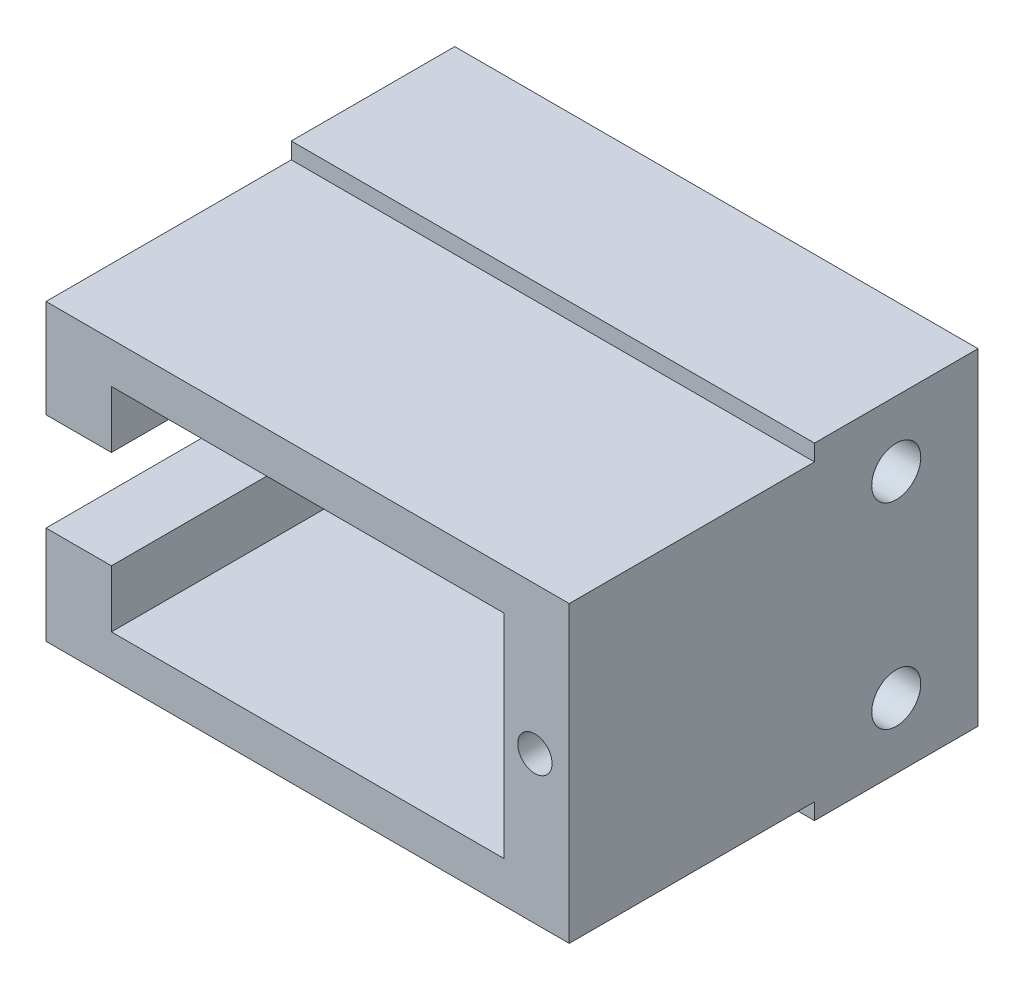
ISO-10303-21;
HEADER;
FILE_DESCRIPTION(('STEP AP214'),'2;1');
FILE_NAME('part.step','',(''),(''),'','','');
FILE_SCHEMA(('AUTOMOTIVE_DESIGN { 1 0 10303 214 1 1 1 1 }'));
ENDSEC;
DATA;
#1=APPLICATION_CONTEXT('core data for automotive mechanical design processes');
#2=APPLICATION_PROTOCOL_DEFINITION('international standard','automotive_design',2000,#1);
#3=PRODUCT_CONTEXT('',#1,'mechanical');
#4=PRODUCT('Part','Part','',(#3));
#5=PRODUCT_RELATED_PRODUCT_CATEGORY('part','',(#4));
#6=PRODUCT_DEFINITION_FORMATION('','',#4);
#7=PRODUCT_DEFINITION_CONTEXT('part definition',#1,'design');
#8=PRODUCT_DEFINITION('design','',#6,#7);
#9=PRODUCT_DEFINITION_SHAPE('','',#8);
#10=(LENGTH_UNIT() NAMED_UNIT(*) SI_UNIT(.MILLI.,.METRE.));
#11=(NAMED_UNIT(*) PLANE_ANGLE_UNIT() SI_UNIT($,.RADIAN.));
#12=(NAMED_UNIT(*) SI_UNIT($,.STERADIAN.) SOLID_ANGLE_UNIT());
#13=UNCERTAINTY_MEASURE_WITH_UNIT(LENGTH_MEASURE(1.E-05),#10,'distance_accuracy_value','');
#14=(GEOMETRIC_REPRESENTATION_CONTEXT(3) GLOBAL_UNCERTAINTY_ASSIGNED_CONTEXT((#13)) GLOBAL_UNIT_ASSIGNED_CONTEXT((#10,
#11,#12)) REPRESENTATION_CONTEXT('',''));
#15=CARTESIAN_POINT('',(0.,0.,0.));
#16=DIRECTION('',(0.,0.,1.));
#17=DIRECTION('',(1.,0.,0.));
#18=AXIS2_PLACEMENT_3D('',#15,#16,#17);
#19=CARTESIAN_POINT('',(-16.,10.,10.));
#20=DIRECTION('',(1.,0.,0.));
#21=DIRECTION('',(0.,0.,-1.));
#22=AXIS2_PLACEMENT_3D('',#19,#20,#21);
#23=PLANE('',#22);
#24=DIRECTION('',(0.,-1.,0.));
#25=VECTOR('',#24,1.);
#26=CARTESIAN_POINT('',(-16.,10.,0.));
#27=LINE('',#26,#25);
#28=CARTESIAN_POINT('',(-16.,10.,0.));
#29=VERTEX_POINT('',#28);
#30=CARTESIAN_POINT('',(-16.,3.,0.));
#31=VERTEX_POINT('',#30);
#32=EDGE_CURVE('E261',#29,#31,#27,.T.);
#33=ORIENTED_EDGE('',*,*,#32,.T.);
#34=DIRECTION('',(0.,0.,-1.));
#35=VECTOR('',#34,1.);
#36=CARTESIAN_POINT('',(-16.,3.,0.));
#37=LINE('',#36,#35);
#38=CARTESIAN_POINT('',(-16.,3.,25.));
#39=VERTEX_POINT('',#38);
#40=EDGE_CURVE('E167',#39,#31,#37,.T.);
#41=ORIENTED_EDGE('',*,*,#40,.F.);
#42=DIRECTION('',(0.,-1.,0.));
#43=VECTOR('',#42,1.);
#44=CARTESIAN_POINT('',(-16.,-9.00000000000001,25.));
#45=LINE('',#44,#43);
#46=CARTESIAN_POINT('',(-16.,9.,25.));
#47=VERTEX_POINT('',#46);
#48=EDGE_CURVE('E218',#47,#39,#45,.T.);
#49=ORIENTED_EDGE('',*,*,#48,.F.);
#50=DIRECTION('',(0.,0.,-1.));
#51=VECTOR('',#50,1.);
#52=CARTESIAN_POINT('',(-16.,9.,25.));
#53=LINE('',#52,#51);
#54=CARTESIAN_POINT('',(-16.,9.,10.));
#55=VERTEX_POINT('',#54);
#56=EDGE_CURVE('E228',#47,#55,#53,.T.);
#57=ORIENTED_EDGE('',*,*,#56,.T.);
#58=DIRECTION('',(0.,-1.,0.));
#59=VECTOR('',#58,1.);
#60=CARTESIAN_POINT('',(-16.,10.,10.));
#61=LINE('',#60,#59);
#62=CARTESIAN_POINT('',(-16.,10.,10.));
#63=VERTEX_POINT('',#62);
#64=EDGE_CURVE('E252',#63,#55,#61,.T.);
#65=ORIENTED_EDGE('',*,*,#64,.F.);
#66=DIRECTION('',(0.,0.,-1.));
#67=VECTOR('',#66,1.);
#68=CARTESIAN_POINT('',(-16.,10.,10.));
#69=LINE('',#68,#67);
#70=EDGE_CURVE('E41',#63,#29,#69,.T.);
#71=ORIENTED_EDGE('',*,*,#70,.T.);
#72=EDGE_LOOP('',(#33,#41,#49,#57,#65,#71));
#73=FACE_BOUND('',#72,.T.);
#74=ADVANCED_FACE('F33',(#73),#23,.F.);
#75=CARTESIAN_POINT('',(-12.,6.5,25.));
#76=DIRECTION('',(1.,0.,0.));
#77=DIRECTION('',(0.,0.,-1.));
#78=AXIS2_PLACEMENT_3D('',#75,#76,#77);
#79=PLANE('',#78);
#80=DIRECTION('',(0.,0.,-1.));
#81=VECTOR('',#80,1.);
#82=CARTESIAN_POINT('',(-12.,3.,0.));
#83=LINE('',#82,#81);
#84=CARTESIAN_POINT('',(-12.,3.,25.));
#85=VERTEX_POINT('',#84);
#86=CARTESIAN_POINT('',(-12.,3.,10.));
#87=VERTEX_POINT('',#86);
#88=EDGE_CURVE('E174',#85,#87,#83,.T.);
#89=ORIENTED_EDGE('',*,*,#88,.T.);
#90=DIRECTION('',(0.,-1.,0.));
#91=VECTOR('',#90,1.);
#92=CARTESIAN_POINT('',(-12.,6.5,10.));
#93=LINE('',#92,#91);
#94=CARTESIAN_POINT('',(-12.,6.5,10.));
#95=VERTEX_POINT('',#94);
#96=EDGE_CURVE('E202',#95,#87,#93,.T.);
#97=ORIENTED_EDGE('',*,*,#96,.F.);
#98=DIRECTION('',(0.,0.,-1.));
#99=VECTOR('',#98,1.);
#100=CARTESIAN_POINT('',(-12.,6.5,25.));
#101=LINE('',#100,#99);
#102=CARTESIAN_POINT('',(-12.,6.5,25.));
#103=VERTEX_POINT('',#102);
#104=EDGE_CURVE('E212',#103,#95,#101,.T.);
#105=ORIENTED_EDGE('',*,*,#104,.F.);
#106=DIRECTION('',(0.,-1.,0.));
#107=VECTOR('',#106,1.);
#108=CARTESIAN_POINT('',(-12.,6.5,25.));
#109=LINE('',#108,#107);
#110=EDGE_CURVE('E189',#103,#85,#109,.T.);
#111=ORIENTED_EDGE('',*,*,#110,.T.);
#112=EDGE_LOOP('',(#89,#97,#105,#111));
#113=FACE_BOUND('',#112,.T.);
#114=ADVANCED_FACE('F355',(#113),#79,.T.);
#115=CARTESIAN_POINT('',(0.,0.,10.));
#116=DIRECTION('',(0.,0.,1.));
#117=DIRECTION('',(1.,0.,0.));
#118=AXIS2_PLACEMENT_3D('',#115,#116,#117);
#119=PLANE('',#118);
#120=DIRECTION('',(-1.,0.,0.));
#121=VECTOR('',#120,1.);
#122=CARTESIAN_POINT('',(-16.,9.,10.));
#123=LINE('',#122,#121);
#124=CARTESIAN_POINT('',(16.,9.,10.));
#125=VERTEX_POINT('',#124);
#126=EDGE_CURVE('E231',#125,#55,#123,.T.);
#127=ORIENTED_EDGE('',*,*,#126,.F.);
#128=DIRECTION('',(0.,1.,0.));
#129=VECTOR('',#128,1.);
#130=CARTESIAN_POINT('',(16.,10.,10.));
#131=LINE('',#130,#129);
#132=CARTESIAN_POINT('',(16.,10.,10.));
#133=VERTEX_POINT('',#132);
#134=EDGE_CURVE('E249',#125,#133,#131,.T.);
#135=ORIENTED_EDGE('',*,*,#134,.T.);
#136=DIRECTION('',(-1.,0.,0.));
#137=VECTOR('',#136,1.);
#138=CARTESIAN_POINT('',(-16.,10.,10.));
#139=LINE('',#138,#137);
#140=EDGE_CURVE('E248',#133,#63,#139,.T.);
#141=ORIENTED_EDGE('',*,*,#140,.T.);
#142=ORIENTED_EDGE('',*,*,#64,.T.);
#143=EDGE_LOOP('',(#127,#135,#141,#142));
#144=FACE_BOUND('',#143,.T.);
#145=ADVANCED_FACE('F316',(#144),#119,.T.);
#146=CARTESIAN_POINT('',(16.,10.,10.));
#147=DIRECTION('',(-1.,0.,0.));
#148=DIRECTION('',(0.,-1.,0.));
#149=AXIS2_PLACEMENT_3D('',#146,#147,#148);
#150=PLANE('',#149);
#151=CARTESIAN_POINT('',(16.,6.,5.));
#152=DIRECTION('',(1.,0.,0.));
#153=DIRECTION('',(0.,1.,0.));
#154=AXIS2_PLACEMENT_3D('',#151,#152,#153);
#155=CIRCLE('',#154,1.5);
#156=CARTESIAN_POINT('',(16.,7.5,5.));
#157=VERTEX_POINT('',#156);
#158=EDGE_CURVE('E298',#157,#157,#155,.T.);
#159=ORIENTED_EDGE('',*,*,#158,.F.);
#160=EDGE_LOOP('',(#159));
#161=FACE_BOUND('',#160,.T.);
#162=CARTESIAN_POINT('',(16.,-6.,5.));
#163=DIRECTION('',(1.,0.,0.));
#164=DIRECTION('',(0.,1.,0.));
#165=AXIS2_PLACEMENT_3D('',#162,#163,#164);
#166=CIRCLE('',#165,1.5);
#167=CARTESIAN_POINT('',(16.,-4.5,5.));
#168=VERTEX_POINT('',#167);
#169=EDGE_CURVE('E292',#168,#168,#166,.T.);
#170=ORIENTED_EDGE('',*,*,#169,.F.);
#171=EDGE_LOOP('',(#170));
#172=FACE_BOUND('',#171,.T.);
#173=DIRECTION('',(0.,1.,0.));
#174=VECTOR('',#173,1.);
#175=CARTESIAN_POINT('',(16.,10.,0.));
#176=LINE('',#175,#174);
#177=CARTESIAN_POINT('',(16.,-10.,0.));
#178=VERTEX_POINT('',#177);
#179=CARTESIAN_POINT('',(16.,10.,0.));
#180=VERTEX_POINT('',#179);
#181=EDGE_CURVE('E245',#178,#180,#176,.T.);
#182=ORIENTED_EDGE('',*,*,#181,.T.);
#183=DIRECTION('',(0.,0.,-1.));
#184=VECTOR('',#183,1.);
#185=CARTESIAN_POINT('',(16.,10.,10.));
#186=LINE('',#185,#184);
#187=EDGE_CURVE('E11',#133,#180,#186,.T.);
#188=ORIENTED_EDGE('',*,*,#187,.F.);
#189=ORIENTED_EDGE('',*,*,#134,.F.);
#190=DIRECTION('',(0.,0.,-1.));
#191=VECTOR('',#190,1.);
#192=CARTESIAN_POINT('',(16.,9.,25.));
#193=LINE('',#192,#191);
#194=CARTESIAN_POINT('',(16.,9.,25.));
#195=VERTEX_POINT('',#194);
#196=EDGE_CURVE('E236',#195,#125,#193,.T.);
#197=ORIENTED_EDGE('',*,*,#196,.F.);
#198=DIRECTION('',(0.,1.,0.));
#199=VECTOR('',#198,1.);
#200=CARTESIAN_POINT('',(16.,9.,25.));
#201=LINE('',#200,#199);
#202=CARTESIAN_POINT('',(16.,-9.,25.));
#203=VERTEX_POINT('',#202);
#204=EDGE_CURVE('E224',#203,#195,#201,.T.);
#205=ORIENTED_EDGE('',*,*,#204,.F.);
#206=DIRECTION('',(0.,0.,-1.));
#207=VECTOR('',#206,1.);
#208=CARTESIAN_POINT('',(16.,-9.,25.));
#209=LINE('',#208,#207);
#210=CARTESIAN_POINT('',(16.,-9.,10.));
#211=VERTEX_POINT('',#210);
#212=EDGE_CURVE('E239',#203,#211,#209,.T.);
#213=ORIENTED_EDGE('',*,*,#212,.T.);
#214=CARTESIAN_POINT('',(16.,-10.,10.));
#215=VERTEX_POINT('',#214);
#216=EDGE_CURVE('E246',#215,#211,#131,.T.);
#217=ORIENTED_EDGE('',*,*,#216,.F.);
#218=DIRECTION('',(0.,0.,-1.));
#219=VECTOR('',#218,1.);
#220=CARTESIAN_POINT('',(16.,-10.,10.));
#221=LINE('',#220,#219);
#222=EDGE_CURVE('E256',#215,#178,#221,.T.);
#223=ORIENTED_EDGE('',*,*,#222,.T.);
#224=EDGE_LOOP('',(#182,#188,#189,#197,#205,#213,#217,#223));
#225=FACE_BOUND('',#224,.T.);
#226=ADVANCED_FACE('F35',(#161,#172,#225),#150,.F.);
#227=CARTESIAN_POINT('',(-16.,10.,10.));
#228=DIRECTION('',(0.,-1.,0.));
#229=DIRECTION('',(0.,0.,-1.));
#230=AXIS2_PLACEMENT_3D('',#227,#228,#229);
#231=PLANE('',#230);
#232=DIRECTION('',(-1.,0.,0.));
#233=VECTOR('',#232,1.);
#234=CARTESIAN_POINT('',(-16.,10.,0.));
#235=LINE('',#234,#233);
#236=EDGE_CURVE('E259',#180,#29,#235,.T.);
#237=ORIENTED_EDGE('',*,*,#236,.T.);
#238=ORIENTED_EDGE('',*,*,#70,.F.);
#239=ORIENTED_EDGE('',*,*,#140,.F.);
#240=ORIENTED_EDGE('',*,*,#187,.T.);
#241=EDGE_LOOP('',(#237,#238,#239,#240));
#242=FACE_BOUND('',#241,.T.);
#243=ADVANCED_FACE('F315',(#242),#231,.F.);
#244=CARTESIAN_POINT('',(-16.,-3.,25.));
#245=VERTEX_POINT('',#244);
#246=CARTESIAN_POINT('',(-16.,-9.00000000000001,25.));
#247=VERTEX_POINT('',#246);
#248=EDGE_CURVE('E222',#245,#247,#45,.T.);
#249=ORIENTED_EDGE('',*,*,#248,.F.);
#250=DIRECTION('',(0.,0.,1.));
#251=VECTOR('',#250,1.);
#252=CARTESIAN_POINT('',(-16.,-3.,25.));
#253=LINE('',#252,#251);
#254=CARTESIAN_POINT('',(-16.,-3.,0.));
#255=VERTEX_POINT('',#254);
#256=EDGE_CURVE('E283',#255,#245,#253,.T.);
#257=ORIENTED_EDGE('',*,*,#256,.F.);
#258=CARTESIAN_POINT('',(-16.,-10.,0.));
#259=VERTEX_POINT('',#258);
#260=EDGE_CURVE('E172',#255,#259,#27,.T.);
#261=ORIENTED_EDGE('',*,*,#260,.T.);
#262=DIRECTION('',(0.,0.,-1.));
#263=VECTOR('',#262,1.);
#264=CARTESIAN_POINT('',(-16.,-10.,10.));
#265=LINE('',#264,#263);
#266=CARTESIAN_POINT('',(-16.,-10.,10.));
#267=VERTEX_POINT('',#266);
#268=EDGE_CURVE('E268',#267,#259,#265,.T.);
#269=ORIENTED_EDGE('',*,*,#268,.F.);
#270=CARTESIAN_POINT('',(-16.,-9.,10.));
#271=VERTEX_POINT('',#270);
#272=EDGE_CURVE('E251',#271,#267,#61,.T.);
#273=ORIENTED_EDGE('',*,*,#272,.F.);
#274=DIRECTION('',(0.,0.,-1.));
#275=VECTOR('',#274,1.);
#276=CARTESIAN_POINT('',(-16.,-9.00000000000001,25.));
#277=LINE('',#276,#275);
#278=EDGE_CURVE('E242',#247,#271,#277,.T.);
#279=ORIENTED_EDGE('',*,*,#278,.F.);
#280=EDGE_LOOP('',(#249,#257,#261,#269,#273,#279));
#281=FACE_BOUND('',#280,.T.);
#282=ADVANCED_FACE('F330',(#281),#23,.F.);
#283=CARTESIAN_POINT('',(-16.,-10.,10.));
#284=DIRECTION('',(0.,1.,0.));
#285=DIRECTION('',(0.,0.,1.));
#286=AXIS2_PLACEMENT_3D('',#283,#284,#285);
#287=PLANE('',#286);
#288=DIRECTION('',(1.,0.,0.));
#289=VECTOR('',#288,1.);
#290=CARTESIAN_POINT('',(-16.,-10.,0.));
#291=LINE('',#290,#289);
#292=EDGE_CURVE('E264',#259,#178,#291,.T.);
#293=ORIENTED_EDGE('',*,*,#292,.T.);
#294=ORIENTED_EDGE('',*,*,#222,.F.);
#295=DIRECTION('',(1.,0.,0.));
#296=VECTOR('',#295,1.);
#297=CARTESIAN_POINT('',(-16.,-10.,10.));
#298=LINE('',#297,#296);
#299=EDGE_CURVE('E254',#267,#215,#298,.T.);
#300=ORIENTED_EDGE('',*,*,#299,.F.);
#301=ORIENTED_EDGE('',*,*,#268,.T.);
#302=EDGE_LOOP('',(#293,#294,#300,#301));
#303=FACE_BOUND('',#302,.T.);
#304=ADVANCED_FACE('F324',(#303),#287,.F.);
#305=DIRECTION('',(1.,0.,0.));
#306=VECTOR('',#305,1.);
#307=CARTESIAN_POINT('',(16.,-9.,10.));
#308=LINE('',#307,#306);
#309=EDGE_CURVE('E217',#271,#211,#308,.T.);
#310=ORIENTED_EDGE('',*,*,#309,.F.);
#311=ORIENTED_EDGE('',*,*,#272,.T.);
#312=ORIENTED_EDGE('',*,*,#299,.T.);
#313=ORIENTED_EDGE('',*,*,#216,.T.);
#314=EDGE_LOOP('',(#310,#311,#312,#313));
#315=FACE_BOUND('',#314,.T.);
#316=ADVANCED_FACE('F370',(#315),#119,.T.);
#317=CARTESIAN_POINT('',(0.,0.,0.));
#318=DIRECTION('',(0.,0.,1.));
#319=DIRECTION('',(1.,0.,0.));
#320=AXIS2_PLACEMENT_3D('',#317,#318,#319);
#321=PLANE('',#320);
#322=DIRECTION('',(0.,-1.,0.));
#323=VECTOR('',#322,1.);
#324=CARTESIAN_POINT('',(-12.,-3.,0.));
#325=LINE('',#324,#323);
#326=CARTESIAN_POINT('',(-12.,3.,0.));
#327=VERTEX_POINT('',#326);
#328=CARTESIAN_POINT('',(-12.,-3.,0.));
#329=VERTEX_POINT('',#328);
#330=EDGE_CURVE('E161',#327,#329,#325,.T.);
#331=ORIENTED_EDGE('',*,*,#330,.F.);
#332=DIRECTION('',(-1.,0.,0.));
#333=VECTOR('',#332,1.);
#334=CARTESIAN_POINT('',(-12.,3.,0.));
#335=LINE('',#334,#333);
#336=EDGE_CURVE('E199',#327,#31,#335,.T.);
#337=ORIENTED_EDGE('',*,*,#336,.T.);
#338=ORIENTED_EDGE('',*,*,#32,.F.);
#339=ORIENTED_EDGE('',*,*,#236,.F.);
#340=ORIENTED_EDGE('',*,*,#181,.F.);
#341=ORIENTED_EDGE('',*,*,#292,.F.);
#342=ORIENTED_EDGE('',*,*,#260,.F.);
#343=DIRECTION('',(-1.,0.,0.));
#344=VECTOR('',#343,1.);
#345=CARTESIAN_POINT('',(-12.,-3.,0.));
#346=LINE('',#345,#344);
#347=EDGE_CURVE('E154',#329,#255,#346,.T.);
#348=ORIENTED_EDGE('',*,*,#347,.F.);
#349=EDGE_LOOP('',(#331,#337,#338,#339,#340,#341,#342,#348));
#350=FACE_BOUND('',#349,.T.);
#351=ADVANCED_FACE('F170',(#350),#321,.F.);
#352=CARTESIAN_POINT('',(0.,0.,25.));
#353=DIRECTION('',(0.,0.,-1.));
#354=DIRECTION('',(-1.,0.,0.));
#355=AXIS2_PLACEMENT_3D('',#352,#353,#354);
#356=PLANE('',#355);
#357=CARTESIAN_POINT('',(13.9,0.,25.));
#358=DIRECTION('',(0.,0.,1.));
#359=DIRECTION('',(1.,0.,0.));
#360=AXIS2_PLACEMENT_3D('',#357,#358,#359);
#361=CIRCLE('',#360,1.05);
#362=CARTESIAN_POINT('',(14.95,0.,25.));
#363=VERTEX_POINT('',#362);
#364=EDGE_CURVE('E286',#363,#363,#361,.T.);
#365=ORIENTED_EDGE('',*,*,#364,.F.);
#366=EDGE_LOOP('',(#365));
#367=FACE_BOUND('',#366,.T.);
#368=ORIENTED_EDGE('',*,*,#48,.T.);
#369=DIRECTION('',(-1.,0.,0.));
#370=VECTOR('',#369,1.);
#371=CARTESIAN_POINT('',(-12.,3.,25.));
#372=LINE('',#371,#370);
#373=EDGE_CURVE('E177',#85,#39,#372,.T.);
#374=ORIENTED_EDGE('',*,*,#373,.F.);
#375=ORIENTED_EDGE('',*,*,#110,.F.);
#376=DIRECTION('',(-1.,0.,0.));
#377=VECTOR('',#376,1.);
#378=CARTESIAN_POINT('',(-12.,6.5,25.));
#379=LINE('',#378,#377);
#380=CARTESIAN_POINT('',(12.,6.5,25.));
#381=VERTEX_POINT('',#380);
#382=EDGE_CURVE('E185',#381,#103,#379,.T.);
#383=ORIENTED_EDGE('',*,*,#382,.F.);
#384=DIRECTION('',(0.,1.,0.));
#385=VECTOR('',#384,1.);
#386=CARTESIAN_POINT('',(12.,6.5,25.));
#387=LINE('',#386,#385);
#388=CARTESIAN_POINT('',(12.,-6.5,25.));
#389=VERTEX_POINT('',#388);
#390=EDGE_CURVE('E183',#389,#381,#387,.T.);
#391=ORIENTED_EDGE('',*,*,#390,.F.);
#392=DIRECTION('',(1.,0.,0.));
#393=VECTOR('',#392,1.);
#394=CARTESIAN_POINT('',(-12.,-6.5,25.));
#395=LINE('',#394,#393);
#396=CARTESIAN_POINT('',(-12.,-6.5,25.));
#397=VERTEX_POINT('',#396);
#398=EDGE_CURVE('E192',#397,#389,#395,.T.);
#399=ORIENTED_EDGE('',*,*,#398,.F.);
#400=CARTESIAN_POINT('',(-12.,-3.,25.));
#401=VERTEX_POINT('',#400);
#402=EDGE_CURVE('E188',#401,#397,#109,.T.);
#403=ORIENTED_EDGE('',*,*,#402,.F.);
#404=DIRECTION('',(-1.,0.,0.));
#405=VECTOR('',#404,1.);
#406=CARTESIAN_POINT('',(-12.,-3.,25.));
#407=LINE('',#406,#405);
#408=EDGE_CURVE('E173',#401,#245,#407,.T.);
#409=ORIENTED_EDGE('',*,*,#408,.T.);
#410=ORIENTED_EDGE('',*,*,#248,.T.);
#411=DIRECTION('',(1.,0.,0.));
#412=VECTOR('',#411,1.);
#413=CARTESIAN_POINT('',(16.,-9.,25.));
#414=LINE('',#413,#412);
#415=EDGE_CURVE('E221',#247,#203,#414,.T.);
#416=ORIENTED_EDGE('',*,*,#415,.T.);
#417=ORIENTED_EDGE('',*,*,#204,.T.);
#418=DIRECTION('',(-1.,0.,0.));
#419=VECTOR('',#418,1.);
#420=CARTESIAN_POINT('',(-16.,9.,25.));
#421=LINE('',#420,#419);
#422=EDGE_CURVE('E226',#195,#47,#421,.T.);
#423=ORIENTED_EDGE('',*,*,#422,.T.);
#424=EDGE_LOOP('',(#368,#374,#375,#383,#391,#399,#403,#409,#410,#416,#417,#423));
#425=FACE_BOUND('',#424,.T.);
#426=ADVANCED_FACE('F334',(#367,#425),#356,.F.);
#427=CARTESIAN_POINT('',(16.,-9.,25.));
#428=DIRECTION('',(0.,1.,0.));
#429=DIRECTION('',(-1.,0.,0.));
#430=AXIS2_PLACEMENT_3D('',#427,#428,#429);
#431=PLANE('',#430);
#432=ORIENTED_EDGE('',*,*,#309,.T.);
#433=ORIENTED_EDGE('',*,*,#212,.F.);
#434=ORIENTED_EDGE('',*,*,#415,.F.);
#435=ORIENTED_EDGE('',*,*,#278,.T.);
#436=EDGE_LOOP('',(#432,#433,#434,#435));
#437=FACE_BOUND('',#436,.T.);
#438=ADVANCED_FACE('F368',(#437),#431,.F.);
#439=CARTESIAN_POINT('',(-16.,9.,25.));
#440=DIRECTION('',(0.,-1.,0.));
#441=DIRECTION('',(0.,0.,-1.));
#442=AXIS2_PLACEMENT_3D('',#439,#440,#441);
#443=PLANE('',#442);
#444=ORIENTED_EDGE('',*,*,#126,.T.);
#445=ORIENTED_EDGE('',*,*,#56,.F.);
#446=ORIENTED_EDGE('',*,*,#422,.F.);
#447=ORIENTED_EDGE('',*,*,#196,.T.);
#448=EDGE_LOOP('',(#444,#445,#446,#447));
#449=FACE_BOUND('',#448,.T.);
#450=ADVANCED_FACE('F364',(#449),#443,.F.);
#451=CARTESIAN_POINT('',(12.,6.5,25.));
#452=DIRECTION('',(-1.,0.,0.));
#453=DIRECTION('',(0.,0.,1.));
#454=AXIS2_PLACEMENT_3D('',#451,#452,#453);
#455=PLANE('',#454);
#456=DIRECTION('',(0.,1.,0.));
#457=VECTOR('',#456,1.);
#458=CARTESIAN_POINT('',(12.,6.5,10.));
#459=LINE('',#458,#457);
#460=CARTESIAN_POINT('',(12.,-6.5,10.));
#461=VERTEX_POINT('',#460);
#462=CARTESIAN_POINT('',(12.,6.5,10.));
#463=VERTEX_POINT('',#462);
#464=EDGE_CURVE('E195',#461,#463,#459,.T.);
#465=ORIENTED_EDGE('',*,*,#464,.F.);
#466=DIRECTION('',(0.,0.,-1.));
#467=VECTOR('',#466,1.);
#468=CARTESIAN_POINT('',(12.,-6.5,25.));
#469=LINE('',#468,#467);
#470=EDGE_CURVE('E194',#389,#461,#469,.T.);
#471=ORIENTED_EDGE('',*,*,#470,.F.);
#472=ORIENTED_EDGE('',*,*,#390,.T.);
#473=DIRECTION('',(0.,0.,-1.));
#474=VECTOR('',#473,1.);
#475=CARTESIAN_POINT('',(12.,6.5,25.));
#476=LINE('',#475,#474);
#477=EDGE_CURVE('E214',#381,#463,#476,.T.);
#478=ORIENTED_EDGE('',*,*,#477,.T.);
#479=EDGE_LOOP('',(#465,#471,#472,#478));
#480=FACE_BOUND('',#479,.T.);
#481=ADVANCED_FACE('F346',(#480),#455,.T.);
#482=CARTESIAN_POINT('',(-12.,6.5,25.));
#483=DIRECTION('',(0.,-1.,0.));
#484=DIRECTION('',(0.,0.,-1.));
#485=AXIS2_PLACEMENT_3D('',#482,#483,#484);
#486=PLANE('',#485);
#487=DIRECTION('',(-1.,0.,0.));
#488=VECTOR('',#487,1.);
#489=CARTESIAN_POINT('',(-12.,6.5,10.));
#490=LINE('',#489,#488);
#491=EDGE_CURVE('E198',#463,#95,#490,.T.);
#492=ORIENTED_EDGE('',*,*,#491,.F.);
#493=ORIENTED_EDGE('',*,*,#477,.F.);
#494=ORIENTED_EDGE('',*,*,#382,.T.);
#495=ORIENTED_EDGE('',*,*,#104,.T.);
#496=EDGE_LOOP('',(#492,#493,#494,#495));
#497=FACE_BOUND('',#496,.T.);
#498=ADVANCED_FACE('F350',(#497),#486,.T.);
#499=DIRECTION('',(0.,0.,1.));
#500=VECTOR('',#499,1.);
#501=CARTESIAN_POINT('',(-12.,-3.,25.));
#502=LINE('',#501,#500);
#503=CARTESIAN_POINT('',(-12.,-3.,10.));
#504=VERTEX_POINT('',#503);
#505=EDGE_CURVE('E157',#504,#401,#502,.T.);
#506=ORIENTED_EDGE('',*,*,#505,.T.);
#507=ORIENTED_EDGE('',*,*,#402,.T.);
#508=DIRECTION('',(0.,0.,-1.));
#509=VECTOR('',#508,1.);
#510=CARTESIAN_POINT('',(-12.,-6.5,25.));
#511=LINE('',#510,#509);
#512=CARTESIAN_POINT('',(-12.,-6.5,10.));
#513=VERTEX_POINT('',#512);
#514=EDGE_CURVE('E209',#397,#513,#511,.T.);
#515=ORIENTED_EDGE('',*,*,#514,.T.);
#516=EDGE_CURVE('E56',#504,#513,#93,.T.);
#517=ORIENTED_EDGE('',*,*,#516,.F.);
#518=EDGE_LOOP('',(#506,#507,#515,#517));
#519=FACE_BOUND('',#518,.T.);
#520=ADVANCED_FACE('F340',(#519),#79,.T.);
#521=CARTESIAN_POINT('',(-12.,-6.5,25.));
#522=DIRECTION('',(0.,1.,0.));
#523=DIRECTION('',(0.,0.,1.));
#524=AXIS2_PLACEMENT_3D('',#521,#522,#523);
#525=PLANE('',#524);
#526=DIRECTION('',(1.,0.,0.));
#527=VECTOR('',#526,1.);
#528=CARTESIAN_POINT('',(-12.,-6.5,10.));
#529=LINE('',#528,#527);
#530=EDGE_CURVE('E186',#513,#461,#529,.T.);
#531=ORIENTED_EDGE('',*,*,#530,.F.);
#532=ORIENTED_EDGE('',*,*,#514,.F.);
#533=ORIENTED_EDGE('',*,*,#398,.T.);
#534=ORIENTED_EDGE('',*,*,#470,.T.);
#535=EDGE_LOOP('',(#531,#532,#533,#534));
#536=FACE_BOUND('',#535,.T.);
#537=ADVANCED_FACE('F342',(#536),#525,.T.);
#538=ORIENTED_EDGE('',*,*,#96,.T.);
#539=EDGE_CURVE('E205',#87,#504,#93,.T.);
#540=ORIENTED_EDGE('',*,*,#539,.T.);
#541=ORIENTED_EDGE('',*,*,#516,.T.);
#542=ORIENTED_EDGE('',*,*,#530,.T.);
#543=ORIENTED_EDGE('',*,*,#464,.T.);
#544=ORIENTED_EDGE('',*,*,#491,.T.);
#545=EDGE_LOOP('',(#538,#540,#541,#542,#543,#544));
#546=FACE_BOUND('',#545,.T.);
#547=ADVANCED_FACE('F344',(#546),#119,.T.);
#548=CARTESIAN_POINT('',(-12.,3.,0.));
#549=DIRECTION('',(0.,1.,0.));
#550=DIRECTION('',(0.,0.,1.));
#551=AXIS2_PLACEMENT_3D('',#548,#549,#550);
#552=PLANE('',#551);
#553=ORIENTED_EDGE('',*,*,#40,.T.);
#554=ORIENTED_EDGE('',*,*,#336,.F.);
#555=EDGE_CURVE('E158',#87,#327,#83,.T.);
#556=ORIENTED_EDGE('',*,*,#555,.F.);
#557=ORIENTED_EDGE('',*,*,#88,.F.);
#558=ORIENTED_EDGE('',*,*,#373,.T.);
#559=EDGE_LOOP('',(#553,#554,#556,#557,#558));
#560=FACE_BOUND('',#559,.T.);
#561=ADVANCED_FACE('F357',(#560),#552,.F.);
#562=CARTESIAN_POINT('',(-12.,-3.,25.));
#563=DIRECTION('',(0.,-1.,0.));
#564=DIRECTION('',(0.,0.,-1.));
#565=AXIS2_PLACEMENT_3D('',#562,#563,#564);
#566=PLANE('',#565);
#567=ORIENTED_EDGE('',*,*,#256,.T.);
#568=ORIENTED_EDGE('',*,*,#408,.F.);
#569=ORIENTED_EDGE('',*,*,#505,.F.);
#570=EDGE_CURVE('E48',#329,#504,#502,.T.);
#571=ORIENTED_EDGE('',*,*,#570,.F.);
#572=ORIENTED_EDGE('',*,*,#347,.T.);
#573=EDGE_LOOP('',(#567,#568,#569,#571,#572));
#574=FACE_BOUND('',#573,.T.);
#575=ADVANCED_FACE('F152',(#574),#566,.F.);
#576=CARTESIAN_POINT('',(-12.,0.,0.));
#577=DIRECTION('',(1.,0.,0.));
#578=DIRECTION('',(0.,0.,-1.));
#579=AXIS2_PLACEMENT_3D('',#576,#577,#578);
#580=PLANE('',#579);
#581=ORIENTED_EDGE('',*,*,#539,.F.);
#582=ORIENTED_EDGE('',*,*,#555,.T.);
#583=ORIENTED_EDGE('',*,*,#330,.T.);
#584=ORIENTED_EDGE('',*,*,#570,.T.);
#585=EDGE_LOOP('',(#581,#582,#583,#584));
#586=FACE_BOUND('',#585,.T.);
#587=ADVANCED_FACE('F162',(#586),#580,.F.);
#588=CARTESIAN_POINT('',(13.9,0.,19.));
#589=DIRECTION('',(0.,0.,1.));
#590=DIRECTION('',(1.,0.,0.));
#591=AXIS2_PLACEMENT_3D('',#588,#589,#590);
#592=CYLINDRICAL_SURFACE('',#591,1.05);
#593=CARTESIAN_POINT('',(13.9,0.,19.));
#594=DIRECTION('',(0.,0.,1.));
#595=DIRECTION('',(1.,0.,0.));
#596=AXIS2_PLACEMENT_3D('',#593,#594,#595);
#597=CIRCLE('',#596,1.05);
#598=CARTESIAN_POINT('',(14.95,0.,19.));
#599=VERTEX_POINT('',#598);
#600=EDGE_CURVE('E284',#599,#599,#597,.T.);
#601=ORIENTED_EDGE('',*,*,#600,.F.);
#602=EDGE_LOOP('',(#601));
#603=FACE_BOUND('',#602,.T.);
#604=ORIENTED_EDGE('',*,*,#364,.T.);
#605=EDGE_LOOP('',(#604));
#606=FACE_BOUND('',#605,.T.);
#607=ADVANCED_FACE('F469',(#603,#606),#592,.F.);
#608=CARTESIAN_POINT('',(13.9,0.,19.));
#609=DIRECTION('',(0.,0.,1.));
#610=DIRECTION('',(1.,0.,0.));
#611=AXIS2_PLACEMENT_3D('',#608,#609,#610);
#612=PLANE('',#611);
#613=ORIENTED_EDGE('',*,*,#600,.T.);
#614=EDGE_LOOP('',(#613));
#615=FACE_BOUND('',#614,.T.);
#616=ADVANCED_FACE('F486',(#615),#612,.T.);
#617=CARTESIAN_POINT('',(-4.,-6.,5.));
#618=DIRECTION('',(1.,0.,0.));
#619=DIRECTION('',(0.,1.,0.));
#620=AXIS2_PLACEMENT_3D('',#617,#618,#619);
#621=CYLINDRICAL_SURFACE('',#620,1.5);
#622=CARTESIAN_POINT('',(-4.,-6.,5.));
#623=DIRECTION('',(1.,0.,0.));
#624=DIRECTION('',(0.,1.,0.));
#625=AXIS2_PLACEMENT_3D('',#622,#623,#624);
#626=CIRCLE('',#625,1.5);
#627=CARTESIAN_POINT('',(-4.,-4.5,5.));
#628=VERTEX_POINT('',#627);
#629=EDGE_CURVE('E295',#628,#628,#626,.T.);
#630=ORIENTED_EDGE('',*,*,#629,.F.);
#631=EDGE_LOOP('',(#630));
#632=FACE_BOUND('',#631,.T.);
#633=ORIENTED_EDGE('',*,*,#169,.T.);
#634=EDGE_LOOP('',(#633));
#635=FACE_BOUND('',#634,.T.);
#636=ADVANCED_FACE('F495',(#632,#635),#621,.F.);
#637=CARTESIAN_POINT('',(-4.,-6.,5.));
#638=DIRECTION('',(1.,0.,0.));
#639=DIRECTION('',(0.,1.,0.));
#640=AXIS2_PLACEMENT_3D('',#637,#638,#639);
#641=PLANE('',#640);
#642=ORIENTED_EDGE('',*,*,#629,.T.);
#643=EDGE_LOOP('',(#642));
#644=FACE_BOUND('',#643,.T.);
#645=ADVANCED_FACE('F309',(#644),#641,.T.);
#646=CARTESIAN_POINT('',(-4.,6.,5.));
#647=DIRECTION('',(1.,0.,0.));
#648=DIRECTION('',(0.,1.,0.));
#649=AXIS2_PLACEMENT_3D('',#646,#647,#648);
#650=CYLINDRICAL_SURFACE('',#649,1.5);
#651=CARTESIAN_POINT('',(-4.,6.,5.));
#652=DIRECTION('',(1.,0.,0.));
#653=DIRECTION('',(0.,1.,0.));
#654=AXIS2_PLACEMENT_3D('',#651,#652,#653);
#655=CIRCLE('',#654,1.5);
#656=CARTESIAN_POINT('',(-4.,7.5,5.));
#657=VERTEX_POINT('',#656);
#658=EDGE_CURVE('E289',#657,#657,#655,.T.);
#659=ORIENTED_EDGE('',*,*,#658,.F.);
#660=EDGE_LOOP('',(#659));
#661=FACE_BOUND('',#660,.T.);
#662=ORIENTED_EDGE('',*,*,#158,.T.);
#663=EDGE_LOOP('',(#662));
#664=FACE_BOUND('',#663,.T.);
#665=ADVANCED_FACE('F306',(#661,#664),#650,.F.);
#666=CARTESIAN_POINT('',(-4.,6.,5.));
#667=DIRECTION('',(1.,0.,0.));
#668=DIRECTION('',(0.,1.,0.));
#669=AXIS2_PLACEMENT_3D('',#666,#667,#668);
#670=PLANE('',#669);
#671=ORIENTED_EDGE('',*,*,#658,.T.);
#672=EDGE_LOOP('',(#671));
#673=FACE_BOUND('',#672,.T.);
#674=ADVANCED_FACE('F304',(#673),#670,.T.);
#675=CLOSED_SHELL('',(#74,#114,#145,#226,#243,#282,#304,#316,#351,#426,#438,#450,#481,#498,#520,
#537,#547,#561,#575,#587,#607,#616,#636,#645,#665,#674));
#676=MANIFOLD_SOLID_BREP('B2',#675);
#677=ADVANCED_BREP_SHAPE_REPRESENTATION('',(#18,#676),#14);
#678=SHAPE_DEFINITION_REPRESENTATION(#9,#677);
ENDSEC;
END-ISO-10303-21;
